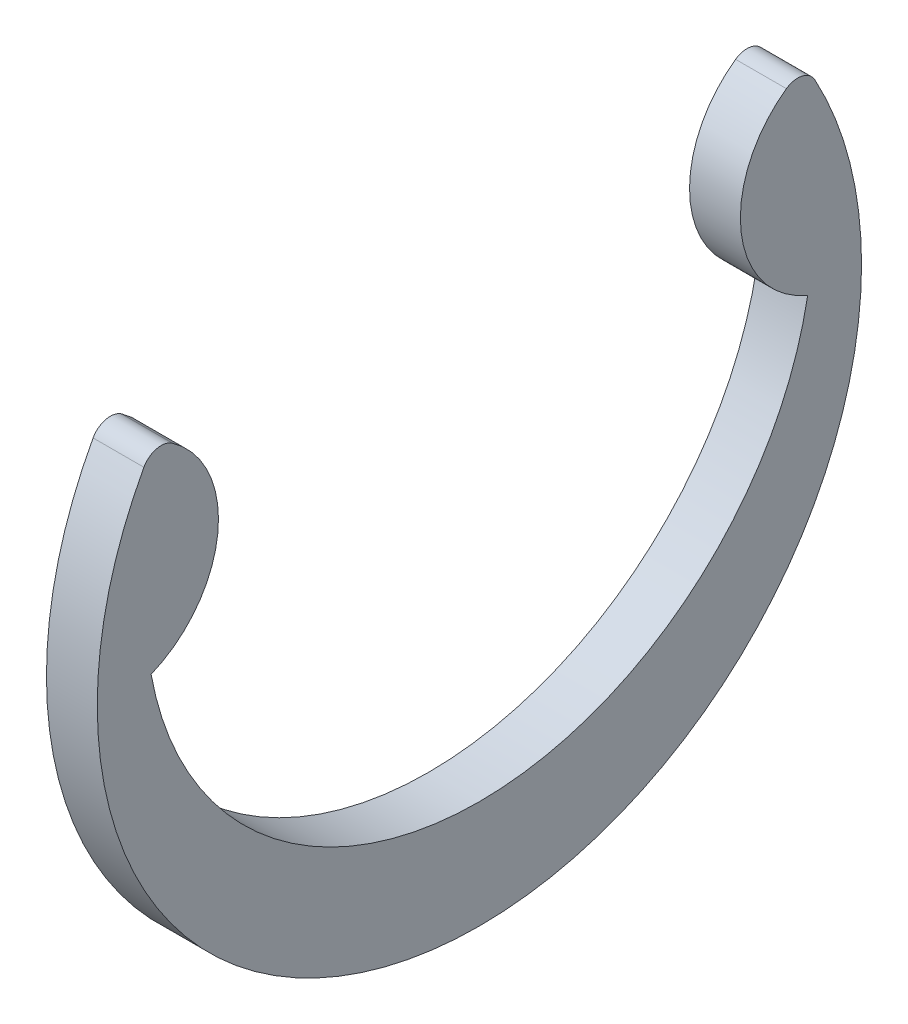
ISO-10303-21;
HEADER;
FILE_DESCRIPTION(('STEP AP214'),'2;1');
FILE_NAME('part.step','',(''),(''),'','','');
FILE_SCHEMA(('AUTOMOTIVE_DESIGN { 1 0 10303 214 1 1 1 1 }'));
ENDSEC;
DATA;
#1=APPLICATION_CONTEXT('core data for automotive mechanical design processes');
#2=APPLICATION_PROTOCOL_DEFINITION('international standard','automotive_design',2000,#1);
#3=PRODUCT_CONTEXT('',#1,'mechanical');
#4=PRODUCT('Part','Part','',(#3));
#5=PRODUCT_RELATED_PRODUCT_CATEGORY('part','',(#4));
#6=PRODUCT_DEFINITION_FORMATION('','',#4);
#7=PRODUCT_DEFINITION_CONTEXT('part definition',#1,'design');
#8=PRODUCT_DEFINITION('design','',#6,#7);
#9=PRODUCT_DEFINITION_SHAPE('','',#8);
#10=(LENGTH_UNIT() NAMED_UNIT(*) SI_UNIT(.MILLI.,.METRE.));
#11=(NAMED_UNIT(*) PLANE_ANGLE_UNIT() SI_UNIT($,.RADIAN.));
#12=(NAMED_UNIT(*) SI_UNIT($,.STERADIAN.) SOLID_ANGLE_UNIT());
#13=UNCERTAINTY_MEASURE_WITH_UNIT(LENGTH_MEASURE(1.E-05),#10,'distance_accuracy_value','');
#14=(GEOMETRIC_REPRESENTATION_CONTEXT(3) GLOBAL_UNCERTAINTY_ASSIGNED_CONTEXT((#13)) GLOBAL_UNIT_ASSIGNED_CONTEXT((#10,
#11,#12)) REPRESENTATION_CONTEXT('',''));
#15=CARTESIAN_POINT('',(0.,0.,0.));
#16=DIRECTION('',(0.,0.,1.));
#17=DIRECTION('',(1.,0.,0.));
#18=AXIS2_PLACEMENT_3D('',#15,#16,#17);
#19=CARTESIAN_POINT('',(0.3175,1.25751058195202,4.62154288834463));
#20=DIRECTION('',(-1.,0.,0.));
#21=DIRECTION('',(0.,0.,1.));
#22=AXIS2_PLACEMENT_3D('',#19,#20,#21);
#23=CYLINDRICAL_SURFACE('',#22,1.36057112198265);
#24=CARTESIAN_POINT('',(-0.3175,1.25751058195202,4.62154288834463));
#25=DIRECTION('',(1.,0.,0.));
#26=DIRECTION('',(0.,0.,1.));
#27=AXIS2_PLACEMENT_3D('',#24,#25,#26);
#28=CIRCLE('',#27,1.36057112198265);
#29=CARTESIAN_POINT('',(-0.3175,0.,4.1021));
#30=VERTEX_POINT('',#29);
#31=CARTESIAN_POINT('',(-0.3175,2.36870352551948,3.8364288710586));
#32=VERTEX_POINT('',#31);
#33=EDGE_CURVE('E120',#30,#32,#28,.T.);
#34=ORIENTED_EDGE('',*,*,#33,.T.);
#35=DIRECTION('',(-1.,0.,0.));
#36=VECTOR('',#35,1.);
#37=CARTESIAN_POINT('',(0.3175,2.36870352551948,3.8364288710586));
#38=LINE('',#37,#36);
#39=CARTESIAN_POINT('',(0.3175,2.36870352551948,3.8364288710586));
#40=VERTEX_POINT('',#39);
#41=EDGE_CURVE('E11',#40,#32,#38,.T.);
#42=ORIENTED_EDGE('',*,*,#41,.F.);
#43=CARTESIAN_POINT('',(0.3175,1.25751058195202,4.62154288834463));
#44=DIRECTION('',(1.,0.,0.));
#45=DIRECTION('',(0.,0.,1.));
#46=AXIS2_PLACEMENT_3D('',#43,#44,#45);
#47=CIRCLE('',#46,1.36057112198265);
#48=CARTESIAN_POINT('',(0.3175,0.,4.1021));
#49=VERTEX_POINT('',#48);
#50=EDGE_CURVE('E130',#49,#40,#47,.T.);
#51=ORIENTED_EDGE('',*,*,#50,.F.);
#52=DIRECTION('',(-1.,0.,0.));
#53=VECTOR('',#52,1.);
#54=CARTESIAN_POINT('',(0.3175,0.,4.1021));
#55=LINE('',#54,#53);
#56=EDGE_CURVE('E116',#49,#30,#55,.T.);
#57=ORIENTED_EDGE('',*,*,#56,.T.);
#58=EDGE_LOOP('',(#34,#42,#51,#57));
#59=FACE_BOUND('',#58,.T.);
#60=ADVANCED_FACE('F36',(#59),#23,.T.);
#61=CARTESIAN_POINT('',(0.3175,2.16885915455271,3.97762902700811));
#62=DIRECTION('',(-1.,0.,0.));
#63=DIRECTION('',(0.,0.,1.));
#64=AXIS2_PLACEMENT_3D('',#61,#62,#63);
#65=CYLINDRICAL_SURFACE('',#64,0.244694210489893);
#66=CARTESIAN_POINT('',(-0.3175,2.16885915455271,3.97762902700811));
#67=DIRECTION('',(1.,0.,0.));
#68=DIRECTION('',(0.,0.,1.));
#69=AXIS2_PLACEMENT_3D('',#66,#67,#68);
#70=CIRCLE('',#69,0.244694210489893);
#71=CARTESIAN_POINT('',(-0.3175,2.286,4.19246216917935));
#72=VERTEX_POINT('',#71);
#73=EDGE_CURVE('E123',#32,#72,#70,.T.);
#74=ORIENTED_EDGE('',*,*,#73,.T.);
#75=DIRECTION('',(-1.,0.,0.));
#76=VECTOR('',#75,1.);
#77=CARTESIAN_POINT('',(0.3175,2.286,4.19246216917935));
#78=LINE('',#77,#76);
#79=CARTESIAN_POINT('',(0.3175,2.286,4.19246216917935));
#80=VERTEX_POINT('',#79);
#81=EDGE_CURVE('E44',#80,#72,#78,.T.);
#82=ORIENTED_EDGE('',*,*,#81,.F.);
#83=CARTESIAN_POINT('',(0.3175,2.16885915455271,3.97762902700811));
#84=DIRECTION('',(1.,0.,0.));
#85=DIRECTION('',(0.,0.,1.));
#86=AXIS2_PLACEMENT_3D('',#83,#84,#85);
#87=CIRCLE('',#86,0.244694210489893);
#88=EDGE_CURVE('E89',#40,#80,#87,.T.);
#89=ORIENTED_EDGE('',*,*,#88,.F.);
#90=ORIENTED_EDGE('',*,*,#41,.T.);
#91=EDGE_LOOP('',(#74,#82,#89,#90));
#92=FACE_BOUND('',#91,.T.);
#93=ADVANCED_FACE('F154',(#92),#65,.T.);
#94=CARTESIAN_POINT('',(0.3175,0.,0.));
#95=DIRECTION('',(-1.,0.,0.));
#96=DIRECTION('',(0.,0.,1.));
#97=AXIS2_PLACEMENT_3D('',#94,#95,#96);
#98=CYLINDRICAL_SURFACE('',#97,4.7752);
#99=CARTESIAN_POINT('',(-0.3175,0.,0.));
#100=DIRECTION('',(1.,0.,0.));
#101=DIRECTION('',(0.,0.,1.));
#102=AXIS2_PLACEMENT_3D('',#99,#100,#101);
#103=CIRCLE('',#102,4.7752);
#104=CARTESIAN_POINT('',(-0.3175,2.286,-4.19246216917935));
#105=VERTEX_POINT('',#104);
#106=EDGE_CURVE('E125',#72,#105,#103,.T.);
#107=ORIENTED_EDGE('',*,*,#106,.T.);
#108=DIRECTION('',(-1.,0.,0.));
#109=VECTOR('',#108,1.);
#110=CARTESIAN_POINT('',(0.3175,2.286,-4.19246216917935));
#111=LINE('',#110,#109);
#112=CARTESIAN_POINT('',(0.3175,2.286,-4.19246216917935));
#113=VERTEX_POINT('',#112);
#114=EDGE_CURVE('E111',#113,#105,#111,.T.);
#115=ORIENTED_EDGE('',*,*,#114,.F.);
#116=CARTESIAN_POINT('',(0.3175,0.,0.));
#117=DIRECTION('',(1.,0.,0.));
#118=DIRECTION('',(0.,0.,1.));
#119=AXIS2_PLACEMENT_3D('',#116,#117,#118);
#120=CIRCLE('',#119,4.7752);
#121=EDGE_CURVE('E102',#80,#113,#120,.T.);
#122=ORIENTED_EDGE('',*,*,#121,.F.);
#123=ORIENTED_EDGE('',*,*,#81,.T.);
#124=EDGE_LOOP('',(#107,#115,#122,#123));
#125=FACE_BOUND('',#124,.T.);
#126=ADVANCED_FACE('F136',(#125),#98,.T.);
#127=CARTESIAN_POINT('',(0.3175,2.16885915455271,-3.97762902700811));
#128=DIRECTION('',(-1.,0.,0.));
#129=DIRECTION('',(0.,0.,1.));
#130=AXIS2_PLACEMENT_3D('',#127,#128,#129);
#131=CYLINDRICAL_SURFACE('',#130,0.244694210489893);
#132=CARTESIAN_POINT('',(-0.3175,2.16885915455271,-3.97762902700811));
#133=DIRECTION('',(1.,0.,0.));
#134=DIRECTION('',(0.,0.,-1.));
#135=AXIS2_PLACEMENT_3D('',#132,#133,#134);
#136=CIRCLE('',#135,0.244694210489893);
#137=CARTESIAN_POINT('',(-0.3175,2.36870352551948,-3.8364288710586));
#138=VERTEX_POINT('',#137);
#139=EDGE_CURVE('E110',#105,#138,#136,.T.);
#140=ORIENTED_EDGE('',*,*,#139,.T.);
#141=DIRECTION('',(-1.,0.,0.));
#142=VECTOR('',#141,1.);
#143=CARTESIAN_POINT('',(0.3175,2.36870352551948,-3.8364288710586));
#144=LINE('',#143,#142);
#145=CARTESIAN_POINT('',(0.3175,2.36870352551948,-3.8364288710586));
#146=VERTEX_POINT('',#145);
#147=EDGE_CURVE('E107',#146,#138,#144,.T.);
#148=ORIENTED_EDGE('',*,*,#147,.F.);
#149=CARTESIAN_POINT('',(0.3175,2.16885915455271,-3.97762902700811));
#150=DIRECTION('',(1.,0.,0.));
#151=DIRECTION('',(0.,0.,-1.));
#152=AXIS2_PLACEMENT_3D('',#149,#150,#151);
#153=CIRCLE('',#152,0.244694210489893);
#154=EDGE_CURVE('E96',#113,#146,#153,.T.);
#155=ORIENTED_EDGE('',*,*,#154,.F.);
#156=ORIENTED_EDGE('',*,*,#114,.T.);
#157=EDGE_LOOP('',(#140,#148,#155,#156));
#158=FACE_BOUND('',#157,.T.);
#159=ADVANCED_FACE('F108',(#158),#131,.T.);
#160=CARTESIAN_POINT('',(0.3175,1.25751058195202,-4.62154288834463));
#161=DIRECTION('',(-1.,0.,0.));
#162=DIRECTION('',(0.,0.,1.));
#163=AXIS2_PLACEMENT_3D('',#160,#161,#162);
#164=CYLINDRICAL_SURFACE('',#163,1.36057112198265);
#165=CARTESIAN_POINT('',(-0.3175,1.25751058195202,-4.62154288834463));
#166=DIRECTION('',(1.,0.,0.));
#167=DIRECTION('',(0.,0.,1.));
#168=AXIS2_PLACEMENT_3D('',#165,#166,#167);
#169=CIRCLE('',#168,1.36057112198265);
#170=CARTESIAN_POINT('',(-0.3175,0.,-4.1021));
#171=VERTEX_POINT('',#170);
#172=EDGE_CURVE('E75',#138,#171,#169,.T.);
#173=ORIENTED_EDGE('',*,*,#172,.T.);
#174=DIRECTION('',(-1.,0.,0.));
#175=VECTOR('',#174,1.);
#176=CARTESIAN_POINT('',(0.3175,0.,-4.1021));
#177=LINE('',#176,#175);
#178=CARTESIAN_POINT('',(0.3175,0.,-4.1021));
#179=VERTEX_POINT('',#178);
#180=EDGE_CURVE('E112',#179,#171,#177,.T.);
#181=ORIENTED_EDGE('',*,*,#180,.F.);
#182=CARTESIAN_POINT('',(0.3175,1.25751058195202,-4.62154288834463));
#183=DIRECTION('',(1.,0.,0.));
#184=DIRECTION('',(0.,0.,1.));
#185=AXIS2_PLACEMENT_3D('',#182,#183,#184);
#186=CIRCLE('',#185,1.36057112198265);
#187=EDGE_CURVE('E100',#146,#179,#186,.T.);
#188=ORIENTED_EDGE('',*,*,#187,.F.);
#189=ORIENTED_EDGE('',*,*,#147,.T.);
#190=EDGE_LOOP('',(#173,#181,#188,#189));
#191=FACE_BOUND('',#190,.T.);
#192=ADVANCED_FACE('F114',(#191),#164,.T.);
#193=CARTESIAN_POINT('',(0.3175,0.739163518518519,0.));
#194=DIRECTION('',(-1.,0.,0.));
#195=DIRECTION('',(0.,0.,1.));
#196=AXIS2_PLACEMENT_3D('',#193,#194,#195);
#197=CYLINDRICAL_SURFACE('',#196,4.16816351851852);
#198=CARTESIAN_POINT('',(-0.3175,0.739163518518519,0.));
#199=DIRECTION('',(-1.,0.,0.));
#200=DIRECTION('',(0.,0.,-1.));
#201=AXIS2_PLACEMENT_3D('',#198,#199,#200);
#202=CIRCLE('',#201,4.16816351851852);
#203=EDGE_CURVE('E81',#171,#30,#202,.T.);
#204=ORIENTED_EDGE('',*,*,#203,.T.);
#205=ORIENTED_EDGE('',*,*,#56,.F.);
#206=CARTESIAN_POINT('',(0.3175,0.739163518518519,0.));
#207=DIRECTION('',(-1.,0.,0.));
#208=DIRECTION('',(0.,0.,-1.));
#209=AXIS2_PLACEMENT_3D('',#206,#207,#208);
#210=CIRCLE('',#209,4.16816351851852);
#211=EDGE_CURVE('E52',#179,#49,#210,.T.);
#212=ORIENTED_EDGE('',*,*,#211,.F.);
#213=ORIENTED_EDGE('',*,*,#180,.T.);
#214=EDGE_LOOP('',(#204,#205,#212,#213));
#215=FACE_BOUND('',#214,.T.);
#216=ADVANCED_FACE('F143',(#215),#197,.F.);
#217=CARTESIAN_POINT('',(0.3175,0.998337050235271,2.31077144417232));
#218=DIRECTION('',(-1.,0.,0.));
#219=DIRECTION('',(0.,0.,1.));
#220=AXIS2_PLACEMENT_3D('',#217,#218,#219);
#221=PLANE('',#220);
#222=ORIENTED_EDGE('',*,*,#50,.T.);
#223=ORIENTED_EDGE('',*,*,#88,.T.);
#224=ORIENTED_EDGE('',*,*,#121,.T.);
#225=ORIENTED_EDGE('',*,*,#154,.T.);
#226=ORIENTED_EDGE('',*,*,#187,.T.);
#227=ORIENTED_EDGE('',*,*,#211,.T.);
#228=EDGE_LOOP('',(#222,#223,#224,#225,#226,#227));
#229=FACE_BOUND('',#228,.T.);
#230=ADVANCED_FACE('F98',(#229),#221,.F.);
#231=CARTESIAN_POINT('',(-0.3175,0.998337050235271,2.31077144417232));
#232=DIRECTION('',(-1.,0.,0.));
#233=DIRECTION('',(0.,0.,1.));
#234=AXIS2_PLACEMENT_3D('',#231,#232,#233);
#235=PLANE('',#234);
#236=ORIENTED_EDGE('',*,*,#33,.F.);
#237=ORIENTED_EDGE('',*,*,#203,.F.);
#238=ORIENTED_EDGE('',*,*,#172,.F.);
#239=ORIENTED_EDGE('',*,*,#139,.F.);
#240=ORIENTED_EDGE('',*,*,#106,.F.);
#241=ORIENTED_EDGE('',*,*,#73,.F.);
#242=EDGE_LOOP('',(#236,#237,#238,#239,#240,#241));
#243=FACE_BOUND('',#242,.T.);
#244=ADVANCED_FACE('F139',(#243),#235,.T.);
#245=CLOSED_SHELL('',(#60,#93,#126,#159,#192,#216,#230,#244));
#246=MANIFOLD_SOLID_BREP('B2',#245);
#247=ADVANCED_BREP_SHAPE_REPRESENTATION('',(#18,#246),#14);
#248=SHAPE_DEFINITION_REPRESENTATION(#9,#247);
ENDSEC;
END-ISO-10303-21;
